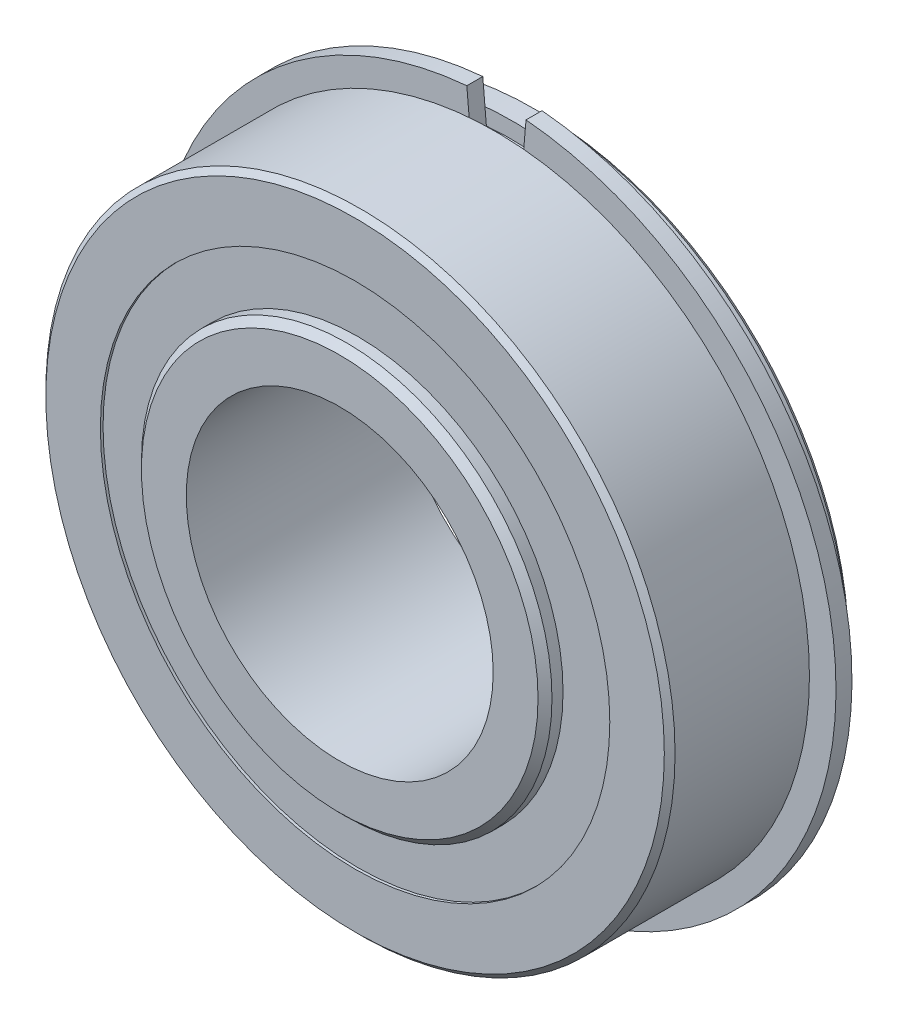
ISO-10303-21;
HEADER;
FILE_DESCRIPTION(('STEP AP214'),'2;1');
FILE_NAME('part.step','',(''),(''),'','','');
FILE_SCHEMA(('AUTOMOTIVE_DESIGN { 1 0 10303 214 1 1 1 1 }'));
ENDSEC;
DATA;
#1=APPLICATION_CONTEXT('core data for automotive mechanical design processes');
#2=APPLICATION_PROTOCOL_DEFINITION('international standard','automotive_design',2000,#1);
#3=PRODUCT_CONTEXT('',#1,'mechanical');
#4=PRODUCT('Part','Part','',(#3));
#5=PRODUCT_RELATED_PRODUCT_CATEGORY('part','',(#4));
#6=PRODUCT_DEFINITION_FORMATION('','',#4);
#7=PRODUCT_DEFINITION_CONTEXT('part definition',#1,'design');
#8=PRODUCT_DEFINITION('design','',#6,#7);
#9=PRODUCT_DEFINITION_SHAPE('','',#8);
#10=(LENGTH_UNIT() NAMED_UNIT(*) SI_UNIT(.MILLI.,.METRE.));
#11=(NAMED_UNIT(*) PLANE_ANGLE_UNIT() SI_UNIT($,.RADIAN.));
#12=(NAMED_UNIT(*) SI_UNIT($,.STERADIAN.) SOLID_ANGLE_UNIT());
#13=UNCERTAINTY_MEASURE_WITH_UNIT(LENGTH_MEASURE(1.E-05),#10,'distance_accuracy_value','');
#14=(GEOMETRIC_REPRESENTATION_CONTEXT(3) GLOBAL_UNCERTAINTY_ASSIGNED_CONTEXT((#13)) GLOBAL_UNIT_ASSIGNED_CONTEXT((#10,
#11,#12)) REPRESENTATION_CONTEXT('',''));
#15=CARTESIAN_POINT('',(0.,0.,0.));
#16=DIRECTION('',(0.,0.,1.));
#17=DIRECTION('',(1.,0.,0.));
#18=AXIS2_PLACEMENT_3D('',#15,#16,#17);
#19=CARTESIAN_POINT('',(0.,0.,-5.095875));
#20=DIRECTION('',(0.,0.,-1.));
#21=DIRECTION('',(-1.,0.,0.));
#22=AXIS2_PLACEMENT_3D('',#19,#20,#21);
#23=CYLINDRICAL_SURFACE('',#22,35.1282);
#24=CARTESIAN_POINT('',(0.,0.,-6.746875));
#25=DIRECTION('',(0.,0.,1.));
#26=DIRECTION('',(1.,0.,0.));
#27=AXIS2_PLACEMENT_3D('',#24,#25,#26);
#28=CIRCLE('',#27,35.1282);
#29=CARTESIAN_POINT('',(-3.0616243623883,34.9945265935065,-6.746875));
#30=VERTEX_POINT('',#29);
#31=CARTESIAN_POINT('',(3.06162436238829,34.9945265935065,-6.746875));
#32=VERTEX_POINT('',#31);
#33=EDGE_CURVE('E106',#30,#32,#28,.T.);
#34=ORIENTED_EDGE('',*,*,#33,.T.);
#35=DIRECTION('',(0.,0.,-1.));
#36=VECTOR('',#35,1.);
#37=CARTESIAN_POINT('',(3.06162436238829,34.9945265935065,-5.095875));
#38=LINE('',#37,#36);
#39=CARTESIAN_POINT('',(3.06162436238829,34.9945265935065,-5.095875));
#40=VERTEX_POINT('',#39);
#41=EDGE_CURVE('E12',#40,#32,#38,.T.);
#42=ORIENTED_EDGE('',*,*,#41,.F.);
#43=CARTESIAN_POINT('',(0.,0.,-5.095875));
#44=DIRECTION('',(0.,0.,1.));
#45=DIRECTION('',(1.,0.,0.));
#46=AXIS2_PLACEMENT_3D('',#43,#44,#45);
#47=CIRCLE('',#46,35.1282);
#48=CARTESIAN_POINT('',(-3.0616243623883,34.9945265935065,-5.095875));
#49=VERTEX_POINT('',#48);
#50=EDGE_CURVE('E94',#49,#40,#47,.T.);
#51=ORIENTED_EDGE('',*,*,#50,.F.);
#52=DIRECTION('',(0.,0.,-1.));
#53=VECTOR('',#52,1.);
#54=CARTESIAN_POINT('',(-3.0616243623883,34.9945265935065,-5.095875));
#55=LINE('',#54,#53);
#56=EDGE_CURVE('E102',#49,#30,#55,.T.);
#57=ORIENTED_EDGE('',*,*,#56,.T.);
#58=EDGE_LOOP('',(#34,#42,#51,#57));
#59=FACE_BOUND('',#58,.T.);
#60=ADVANCED_FACE('F43',(#59),#23,.T.);
#61=CARTESIAN_POINT('',(2.68983798760795,30.7449888843131,-5.095875));
#62=DIRECTION('',(0.996194698091745,-0.0871557427476582,0.));
#63=DIRECTION('',(0.0871557427476582,0.996194698091746,0.));
#64=AXIS2_PLACEMENT_3D('',#61,#62,#63);
#65=PLANE('',#64);
#66=DIRECTION('',(-0.0871557427476582,-0.996194698091746,0.));
#67=VECTOR('',#66,1.);
#68=CARTESIAN_POINT('',(2.68983798760795,30.7449888843131,-6.746875));
#69=LINE('',#68,#67);
#70=CARTESIAN_POINT('',(2.68983798760796,30.7449888843131,-6.746875));
#71=VERTEX_POINT('',#70);
#72=EDGE_CURVE('E98',#32,#71,#69,.T.);
#73=ORIENTED_EDGE('',*,*,#72,.T.);
#74=DIRECTION('',(0.,0.,-1.));
#75=VECTOR('',#74,1.);
#76=CARTESIAN_POINT('',(2.68983798760796,30.7449888843131,-5.095875));
#77=LINE('',#76,#75);
#78=CARTESIAN_POINT('',(2.68983798760796,30.7449888843131,-5.095875));
#79=VERTEX_POINT('',#78);
#80=EDGE_CURVE('E51',#79,#71,#77,.T.);
#81=ORIENTED_EDGE('',*,*,#80,.F.);
#82=DIRECTION('',(-0.0871557427476582,-0.996194698091746,0.));
#83=VECTOR('',#82,1.);
#84=CARTESIAN_POINT('',(2.68983798760795,30.7449888843131,-5.095875));
#85=LINE('',#84,#83);
#86=EDGE_CURVE('E89',#40,#79,#85,.T.);
#87=ORIENTED_EDGE('',*,*,#86,.F.);
#88=ORIENTED_EDGE('',*,*,#41,.T.);
#89=EDGE_LOOP('',(#73,#81,#87,#88));
#90=FACE_BOUND('',#89,.T.);
#91=ADVANCED_FACE('F97',(#90),#65,.F.);
#92=CARTESIAN_POINT('',(0.,0.,-5.095875));
#93=DIRECTION('',(0.,0.,-1.));
#94=DIRECTION('',(-1.,0.,0.));
#95=AXIS2_PLACEMENT_3D('',#92,#93,#94);
#96=CYLINDRICAL_SURFACE('',#95,30.8624297471232);
#97=CARTESIAN_POINT('',(0.,0.,-6.746875));
#98=DIRECTION('',(0.,0.,-1.));
#99=DIRECTION('',(-1.,0.,0.));
#100=AXIS2_PLACEMENT_3D('',#97,#98,#99);
#101=CIRCLE('',#100,30.8624297471232);
#102=CARTESIAN_POINT('',(-2.68983798760796,30.7449888843131,-6.746875));
#103=VERTEX_POINT('',#102);
#104=EDGE_CURVE('E76',#71,#103,#101,.T.);
#105=ORIENTED_EDGE('',*,*,#104,.T.);
#106=DIRECTION('',(0.,0.,-1.));
#107=VECTOR('',#106,1.);
#108=CARTESIAN_POINT('',(-2.68983798760796,30.7449888843131,-5.095875));
#109=LINE('',#108,#107);
#110=CARTESIAN_POINT('',(-2.68983798760796,30.7449888843131,-5.095875));
#111=VERTEX_POINT('',#110);
#112=EDGE_CURVE('E99',#111,#103,#109,.T.);
#113=ORIENTED_EDGE('',*,*,#112,.F.);
#114=CARTESIAN_POINT('',(0.,0.,-5.095875));
#115=DIRECTION('',(0.,0.,-1.));
#116=DIRECTION('',(-1.,0.,0.));
#117=AXIS2_PLACEMENT_3D('',#114,#115,#116);
#118=CIRCLE('',#117,30.8624297471232);
#119=EDGE_CURVE('E92',#79,#111,#118,.T.);
#120=ORIENTED_EDGE('',*,*,#119,.F.);
#121=ORIENTED_EDGE('',*,*,#80,.T.);
#122=EDGE_LOOP('',(#105,#113,#120,#121));
#123=FACE_BOUND('',#122,.T.);
#124=ADVANCED_FACE('F100',(#123),#96,.F.);
#125=CARTESIAN_POINT('',(-2.68983798760796,30.7449888843131,-5.095875));
#126=DIRECTION('',(-0.996194698091745,-0.0871557427476584,0.));
#127=DIRECTION('',(0.0871557427476584,-0.996194698091746,0.));
#128=AXIS2_PLACEMENT_3D('',#125,#126,#127);
#129=PLANE('',#128);
#130=DIRECTION('',(-0.0871557427476584,0.996194698091746,0.));
#131=VECTOR('',#130,1.);
#132=CARTESIAN_POINT('',(-2.68983798760796,30.7449888843131,-6.746875));
#133=LINE('',#132,#131);
#134=EDGE_CURVE('E82',#103,#30,#133,.T.);
#135=ORIENTED_EDGE('',*,*,#134,.T.);
#136=ORIENTED_EDGE('',*,*,#56,.F.);
#137=DIRECTION('',(-0.0871557427476584,0.996194698091746,0.));
#138=VECTOR('',#137,1.);
#139=CARTESIAN_POINT('',(-2.68983798760796,30.7449888843131,-5.095875));
#140=LINE('',#139,#138);
#141=EDGE_CURVE('E59',#111,#49,#140,.T.);
#142=ORIENTED_EDGE('',*,*,#141,.F.);
#143=ORIENTED_EDGE('',*,*,#112,.T.);
#144=EDGE_LOOP('',(#135,#136,#142,#143));
#145=FACE_BOUND('',#144,.T.);
#146=ADVANCED_FACE('F113',(#145),#129,.F.);
#147=CARTESIAN_POINT('',(0.,0.,-5.095875));
#148=DIRECTION('',(0.,0.,1.));
#149=DIRECTION('',(1.,0.,0.));
#150=AXIS2_PLACEMENT_3D('',#147,#148,#149);
#151=PLANE('',#150);
#152=ORIENTED_EDGE('',*,*,#50,.T.);
#153=ORIENTED_EDGE('',*,*,#86,.T.);
#154=ORIENTED_EDGE('',*,*,#119,.T.);
#155=ORIENTED_EDGE('',*,*,#141,.T.);
#156=EDGE_LOOP('',(#152,#153,#154,#155));
#157=FACE_BOUND('',#156,.T.);
#158=ADVANCED_FACE('F90',(#157),#151,.T.);
#159=CARTESIAN_POINT('',(0.,0.,-6.746875));
#160=DIRECTION('',(0.,0.,1.));
#161=DIRECTION('',(1.,0.,0.));
#162=AXIS2_PLACEMENT_3D('',#159,#160,#161);
#163=PLANE('',#162);
#164=ORIENTED_EDGE('',*,*,#33,.F.);
#165=ORIENTED_EDGE('',*,*,#134,.F.);
#166=ORIENTED_EDGE('',*,*,#104,.F.);
#167=ORIENTED_EDGE('',*,*,#72,.F.);
#168=EDGE_LOOP('',(#164,#165,#166,#167));
#169=FACE_BOUND('',#168,.T.);
#170=ADVANCED_FACE('F116',(#169),#163,.F.);
#171=CLOSED_SHELL('',(#60,#91,#124,#146,#158,#170));
#172=MANIFOLD_SOLID_BREP('B2',#171);
#173=CARTESIAN_POINT('',(0.,26.3479766221232,-9.24718750000001));
#174=DIRECTION('',(0.,0.,1.));
#175=DIRECTION('',(1.,0.,0.));
#176=AXIS2_PLACEMENT_3D('',#173,#174,#175);
#177=PLANE('',#176);
#178=CARTESIAN_POINT('',(0.,0.,-9.24718750000001));
#179=DIRECTION('',(0.,0.,1.));
#180=DIRECTION('',(1.,0.,0.));
#181=AXIS2_PLACEMENT_3D('',#178,#179,#180);
#182=CIRCLE('',#181,26.3479766221232);
#183=CARTESIAN_POINT('',(26.3479766221232,0.,-9.24718750000001));
#184=VERTEX_POINT('',#183);
#185=EDGE_CURVE('E188',#184,#184,#182,.T.);
#186=ORIENTED_EDGE('',*,*,#185,.F.);
#187=EDGE_LOOP('',(#186));
#188=FACE_BOUND('',#187,.T.);
#189=CARTESIAN_POINT('',(0.,0.,-9.24718750000001));
#190=DIRECTION('',(0.,0.,1.));
#191=DIRECTION('',(1.,0.,0.));
#192=AXIS2_PLACEMENT_3D('',#189,#190,#191);
#193=CIRCLE('',#192,21.2344);
#194=CARTESIAN_POINT('',(21.2344,0.,-9.24718750000001));
#195=VERTEX_POINT('',#194);
#196=EDGE_CURVE('E42',#195,#195,#193,.T.);
#197=ORIENTED_EDGE('',*,*,#196,.T.);
#198=EDGE_LOOP('',(#197));
#199=FACE_BOUND('',#198,.T.);
#200=ADVANCED_FACE('F174',(#188,#199),#177,.F.);
#201=CARTESIAN_POINT('',(0.,0.,11.1125));
#202=DIRECTION('',(0.,0.,1.));
#203=DIRECTION('',(1.,0.,0.));
#204=AXIS2_PLACEMENT_3D('',#201,#202,#203);
#205=CYLINDRICAL_SURFACE('',#204,21.2344);
#206=ORIENTED_EDGE('',*,*,#196,.F.);
#207=EDGE_LOOP('',(#206));
#208=FACE_BOUND('',#207,.T.);
#209=CARTESIAN_POINT('',(0.,0.,-4.27720324424649));
#210=DIRECTION('',(0.,0.,1.));
#211=DIRECTION('',(1.,0.,0.));
#212=AXIS2_PLACEMENT_3D('',#209,#210,#211);
#213=CIRCLE('',#212,21.2344);
#214=CARTESIAN_POINT('',(21.2344,0.,-4.27720324424649));
#215=VERTEX_POINT('',#214);
#216=EDGE_CURVE('E180',#215,#215,#213,.T.);
#217=ORIENTED_EDGE('',*,*,#216,.T.);
#218=EDGE_LOOP('',(#217));
#219=FACE_BOUND('',#218,.T.);
#220=ADVANCED_FACE('F197',(#208,#219),#205,.F.);
#221=CARTESIAN_POINT('',(0.,26.3479766221232,-4.27720324424649));
#222=DIRECTION('',(0.,0.,-1.));
#223=DIRECTION('',(-1.,0.,0.));
#224=AXIS2_PLACEMENT_3D('',#221,#222,#223);
#225=PLANE('',#224);
#226=ORIENTED_EDGE('',*,*,#216,.F.);
#227=EDGE_LOOP('',(#226));
#228=FACE_BOUND('',#227,.T.);
#229=CARTESIAN_POINT('',(0.,0.,-4.27720324424649));
#230=DIRECTION('',(0.,0.,1.));
#231=DIRECTION('',(1.,0.,0.));
#232=AXIS2_PLACEMENT_3D('',#229,#230,#231);
#233=CIRCLE('',#232,26.3479766221232);
#234=CARTESIAN_POINT('',(26.3479766221232,0.,-4.27720324424649));
#235=VERTEX_POINT('',#234);
#236=EDGE_CURVE('E184',#235,#235,#233,.T.);
#237=ORIENTED_EDGE('',*,*,#236,.T.);
#238=EDGE_LOOP('',(#237));
#239=FACE_BOUND('',#238,.T.);
#240=ADVANCED_FACE('F201',(#228,#239),#225,.F.);
#241=CARTESIAN_POINT('',(0.,0.,11.1125));
#242=DIRECTION('',(0.,0.,1.));
#243=DIRECTION('',(1.,0.,0.));
#244=AXIS2_PLACEMENT_3D('',#241,#242,#243);
#245=CYLINDRICAL_SURFACE('',#244,26.3479766221232);
#246=ORIENTED_EDGE('',*,*,#236,.F.);
#247=EDGE_LOOP('',(#246));
#248=FACE_BOUND('',#247,.T.);
#249=ORIENTED_EDGE('',*,*,#185,.T.);
#250=EDGE_LOOP('',(#249));
#251=FACE_BOUND('',#250,.T.);
#252=ADVANCED_FACE('F194',(#248,#251),#245,.T.);
#253=CLOSED_SHELL('',(#200,#220,#240,#252));
#254=MANIFOLD_SOLID_BREP('B6',#253);
#255=CARTESIAN_POINT('',(0.,26.3479766221232,9.2471875));
#256=DIRECTION('',(0.,0.,-1.));
#257=DIRECTION('',(-1.,0.,0.));
#258=AXIS2_PLACEMENT_3D('',#255,#256,#257);
#259=PLANE('',#258);
#260=CARTESIAN_POINT('',(0.,0.,9.2471875));
#261=DIRECTION('',(0.,0.,1.));
#262=DIRECTION('',(1.,0.,0.));
#263=AXIS2_PLACEMENT_3D('',#260,#261,#262);
#264=CIRCLE('',#263,21.2344);
#265=CARTESIAN_POINT('',(21.2344,0.,9.2471875));
#266=VERTEX_POINT('',#265);
#267=EDGE_CURVE('E173',#266,#266,#264,.T.);
#268=ORIENTED_EDGE('',*,*,#267,.F.);
#269=EDGE_LOOP('',(#268));
#270=FACE_BOUND('',#269,.T.);
#271=CARTESIAN_POINT('',(0.,0.,9.2471875));
#272=DIRECTION('',(0.,0.,1.));
#273=DIRECTION('',(1.,0.,0.));
#274=AXIS2_PLACEMENT_3D('',#271,#272,#273);
#275=CIRCLE('',#274,26.3479766221232);
#276=CARTESIAN_POINT('',(26.3479766221232,0.,9.2471875));
#277=VERTEX_POINT('',#276);
#278=EDGE_CURVE('E255',#277,#277,#275,.T.);
#279=ORIENTED_EDGE('',*,*,#278,.T.);
#280=EDGE_LOOP('',(#279));
#281=FACE_BOUND('',#280,.T.);
#282=ADVANCED_FACE('F241',(#270,#281),#259,.F.);
#283=CARTESIAN_POINT('',(0.,0.,11.1125));
#284=DIRECTION('',(0.,0.,1.));
#285=DIRECTION('',(1.,0.,0.));
#286=AXIS2_PLACEMENT_3D('',#283,#284,#285);
#287=CYLINDRICAL_SURFACE('',#286,21.2344);
#288=CARTESIAN_POINT('',(0.,0.,4.27720324424647));
#289=DIRECTION('',(0.,0.,1.));
#290=DIRECTION('',(1.,0.,0.));
#291=AXIS2_PLACEMENT_3D('',#288,#289,#290);
#292=CIRCLE('',#291,21.2344);
#293=CARTESIAN_POINT('',(21.2344,0.,4.27720324424647));
#294=VERTEX_POINT('',#293);
#295=EDGE_CURVE('E247',#294,#294,#292,.T.);
#296=ORIENTED_EDGE('',*,*,#295,.F.);
#297=EDGE_LOOP('',(#296));
#298=FACE_BOUND('',#297,.T.);
#299=ORIENTED_EDGE('',*,*,#267,.T.);
#300=EDGE_LOOP('',(#299));
#301=FACE_BOUND('',#300,.T.);
#302=ADVANCED_FACE('F270',(#298,#301),#287,.F.);
#303=CARTESIAN_POINT('',(0.,26.3479766221232,4.27720324424647));
#304=DIRECTION('',(0.,0.,1.));
#305=DIRECTION('',(1.,0.,0.));
#306=AXIS2_PLACEMENT_3D('',#303,#304,#305);
#307=PLANE('',#306);
#308=CARTESIAN_POINT('',(0.,0.,4.27720324424647));
#309=DIRECTION('',(0.,0.,1.));
#310=DIRECTION('',(1.,0.,0.));
#311=AXIS2_PLACEMENT_3D('',#308,#309,#310);
#312=CIRCLE('',#311,26.3479766221232);
#313=CARTESIAN_POINT('',(26.3479766221232,0.,4.27720324424647));
#314=VERTEX_POINT('',#313);
#315=EDGE_CURVE('E251',#314,#314,#312,.T.);
#316=ORIENTED_EDGE('',*,*,#315,.F.);
#317=EDGE_LOOP('',(#316));
#318=FACE_BOUND('',#317,.T.);
#319=ORIENTED_EDGE('',*,*,#295,.T.);
#320=EDGE_LOOP('',(#319));
#321=FACE_BOUND('',#320,.T.);
#322=ADVANCED_FACE('F265',(#318,#321),#307,.F.);
#323=CARTESIAN_POINT('',(0.,0.,11.1125));
#324=DIRECTION('',(0.,0.,1.));
#325=DIRECTION('',(1.,0.,0.));
#326=AXIS2_PLACEMENT_3D('',#323,#324,#325);
#327=CYLINDRICAL_SURFACE('',#326,26.3479766221232);
#328=ORIENTED_EDGE('',*,*,#278,.F.);
#329=EDGE_LOOP('',(#328));
#330=FACE_BOUND('',#329,.T.);
#331=ORIENTED_EDGE('',*,*,#315,.T.);
#332=EDGE_LOOP('',(#331));
#333=FACE_BOUND('',#332,.T.);
#334=ADVANCED_FACE('F262',(#330,#333),#327,.T.);
#335=CLOSED_SHELL('',(#282,#302,#322,#334));
#336=MANIFOLD_SOLID_BREP('B37',#335);
#337=CARTESIAN_POINT('',(-17.1186132307879,17.1186132307883,0.));
#338=DIRECTION('',(0.,0.,1.));
#339=DIRECTION('',(-0.707106781186539,0.707106781186556,0.));
#340=AXIS2_PLACEMENT_3D('',#337,#338,#339);
#341=SPHERICAL_SURFACE('',#340,4.27720324424648);
#342=CARTESIAN_POINT('',(-17.1186132307879,17.1186132307883,4.27720324424647));
#343=VERTEX_POINT('',#342);
#344=VERTEX_LOOP('',#343);
#345=FACE_BOUND('',#344,.T.);
#346=ADVANCED_FACE('F308',(#345),#341,.T.);
#347=CLOSED_SHELL('',(#346));
#348=MANIFOLD_SOLID_BREP('B168',#347);
#349=CARTESIAN_POINT('',(-24.209375,2.53579743112666E-13,0.));
#350=DIRECTION('',(0.,0.,1.));
#351=DIRECTION('',(-1.,0.,0.));
#352=AXIS2_PLACEMENT_3D('',#349,#350,#351);
#353=SPHERICAL_SURFACE('',#352,4.27720324424648);
#354=CARTESIAN_POINT('',(-24.209375,2.53579743112666E-13,4.27720324424647));
#355=VERTEX_POINT('',#354);
#356=VERTEX_LOOP('',#355);
#357=FACE_BOUND('',#356,.T.);
#358=ADVANCED_FACE('F328',(#357),#353,.T.);
#359=CLOSED_SHELL('',(#358));
#360=MANIFOLD_SOLID_BREP('B237',#359);
#361=CARTESIAN_POINT('',(-17.1186132307882,-17.1186132307879,0.));
#362=DIRECTION('',(0.,0.,1.));
#363=DIRECTION('',(-0.707106781186554,-0.707106781186541,0.));
#364=AXIS2_PLACEMENT_3D('',#361,#362,#363);
#365=SPHERICAL_SURFACE('',#364,4.27720324424648);
#366=CARTESIAN_POINT('',(-17.1186132307882,-17.1186132307879,4.27720324424647));
#367=VERTEX_POINT('',#366);
#368=VERTEX_LOOP('',#367);
#369=FACE_BOUND('',#368,.T.);
#370=ADVANCED_FACE('F348',(#369),#365,.T.);
#371=CLOSED_SHELL('',(#370));
#372=MANIFOLD_SOLID_BREP('B304',#371);
#373=CARTESIAN_POINT('',(-1.69053162075111E-13,-24.209375,0.));
#374=DIRECTION('',(0.,0.,1.));
#375=DIRECTION('',(0.,-1.,0.));
#376=AXIS2_PLACEMENT_3D('',#373,#374,#375);
#377=SPHERICAL_SURFACE('',#376,4.27720324424648);
#378=CARTESIAN_POINT('',(-1.69053162075111E-13,-24.209375,4.27720324424647));
#379=VERTEX_POINT('',#378);
#380=VERTEX_LOOP('',#379);
#381=FACE_BOUND('',#380,.T.);
#382=ADVANCED_FACE('F368',(#381),#377,.T.);
#383=CLOSED_SHELL('',(#382));
#384=MANIFOLD_SOLID_BREP('B324',#383);
#385=CARTESIAN_POINT('',(17.118613230788,-17.1186132307882,0.));
#386=DIRECTION('',(0.,0.,1.));
#387=DIRECTION('',(0.707106781186544,-0.707106781186551,0.));
#388=AXIS2_PLACEMENT_3D('',#385,#386,#387);
#389=SPHERICAL_SURFACE('',#388,4.27720324424648);
#390=CARTESIAN_POINT('',(17.118613230788,-17.1186132307882,4.27720324424647));
#391=VERTEX_POINT('',#390);
#392=VERTEX_LOOP('',#391);
#393=FACE_BOUND('',#392,.T.);
#394=ADVANCED_FACE('F388',(#393),#389,.T.);
#395=CLOSED_SHELL('',(#394));
#396=MANIFOLD_SOLID_BREP('B344',#395);
#397=CARTESIAN_POINT('',(24.209375,0.,0.));
#398=DIRECTION('',(0.,0.,1.));
#399=DIRECTION('',(1.,0.,0.));
#400=AXIS2_PLACEMENT_3D('',#397,#398,#399);
#401=SPHERICAL_SURFACE('',#400,4.27720324424648);
#402=CARTESIAN_POINT('',(24.209375,0.,4.27720324424647));
#403=VERTEX_POINT('',#402);
#404=VERTEX_LOOP('',#403);
#405=FACE_BOUND('',#404,.T.);
#406=ADVANCED_FACE('F408',(#405),#401,.T.);
#407=CLOSED_SHELL('',(#406));
#408=MANIFOLD_SOLID_BREP('B364',#407);
#409=CARTESIAN_POINT('',(17.1186132307881,17.118613230788,0.));
#410=DIRECTION('',(0.,0.,1.));
#411=DIRECTION('',(0.707106781186549,0.707106781186546,0.));
#412=AXIS2_PLACEMENT_3D('',#409,#410,#411);
#413=SPHERICAL_SURFACE('',#412,4.27720324424648);
#414=CARTESIAN_POINT('',(17.1186132307881,17.118613230788,4.27720324424647));
#415=VERTEX_POINT('',#414);
#416=VERTEX_LOOP('',#415);
#417=FACE_BOUND('',#416,.T.);
#418=ADVANCED_FACE('F428',(#417),#413,.T.);
#419=CLOSED_SHELL('',(#418));
#420=MANIFOLD_SOLID_BREP('B384',#419);
#421=CARTESIAN_POINT('',(0.,24.209375,0.));
#422=DIRECTION('',(0.,0.,1.));
#423=DIRECTION('',(0.,1.,0.));
#424=AXIS2_PLACEMENT_3D('',#421,#422,#423);
#425=SPHERICAL_SURFACE('',#424,4.27720324424648);
#426=CARTESIAN_POINT('',(0.,24.209375,4.27720324424647));
#427=VERTEX_POINT('',#426);
#428=VERTEX_LOOP('',#427);
#429=FACE_BOUND('',#428,.T.);
#430=ADVANCED_FACE('F450',(#429),#425,.T.);
#431=CLOSED_SHELL('',(#430));
#432=MANIFOLD_SOLID_BREP('B404',#431);
#433=CARTESIAN_POINT('',(0.,0.,-11.1125));
#434=DIRECTION('',(0.,0.,1.));
#435=DIRECTION('',(1.,0.,0.));
#436=AXIS2_PLACEMENT_3D('',#433,#434,#435);
#437=CONICAL_SURFACE('',#436,20.5125628953229,0.785398163397448);
#438=CARTESIAN_POINT('',(0.,0.,-10.3906628953229));
#439=DIRECTION('',(0.,0.,1.));
#440=DIRECTION('',(1.,0.,0.));
#441=AXIS2_PLACEMENT_3D('',#438,#439,#440);
#442=CIRCLE('',#441,21.2344);
#443=CARTESIAN_POINT('',(21.2344,0.,-10.3906628953229));
#444=VERTEX_POINT('',#443);
#445=EDGE_CURVE('E497',#444,#444,#442,.T.);
#446=ORIENTED_EDGE('',*,*,#445,.F.);
#447=EDGE_LOOP('',(#446));
#448=FACE_BOUND('',#447,.T.);
#449=CARTESIAN_POINT('',(0.,0.,-11.1125));
#450=DIRECTION('',(0.,0.,1.));
#451=DIRECTION('',(1.,0.,0.));
#452=AXIS2_PLACEMENT_3D('',#449,#450,#451);
#453=CIRCLE('',#452,20.5125628953229);
#454=CARTESIAN_POINT('',(20.5125628953229,0.,-11.1125));
#455=VERTEX_POINT('',#454);
#456=EDGE_CURVE('E449',#455,#455,#453,.T.);
#457=ORIENTED_EDGE('',*,*,#456,.T.);
#458=EDGE_LOOP('',(#457));
#459=FACE_BOUND('',#458,.T.);
#460=ADVANCED_FACE('F469',(#448,#459),#437,.T.);
#461=CARTESIAN_POINT('',(0.,20.5125628953229,-11.1125));
#462=DIRECTION('',(0.,0.,1.));
#463=DIRECTION('',(1.,0.,0.));
#464=AXIS2_PLACEMENT_3D('',#461,#462,#463);
#465=PLANE('',#464);
#466=ORIENTED_EDGE('',*,*,#456,.F.);
#467=EDGE_LOOP('',(#466));
#468=FACE_BOUND('',#467,.T.);
#469=CARTESIAN_POINT('',(0.,0.,-11.1125));
#470=DIRECTION('',(0.,0.,1.));
#471=DIRECTION('',(1.,0.,0.));
#472=AXIS2_PLACEMENT_3D('',#469,#470,#471);
#473=CIRCLE('',#472,15.875);
#474=CARTESIAN_POINT('',(15.875,0.,-11.1125));
#475=VERTEX_POINT('',#474);
#476=EDGE_CURVE('E475',#475,#475,#473,.T.);
#477=ORIENTED_EDGE('',*,*,#476,.T.);
#478=EDGE_LOOP('',(#477));
#479=FACE_BOUND('',#478,.T.);
#480=ADVANCED_FACE('F504',(#468,#479),#465,.F.);
#481=CARTESIAN_POINT('',(0.,0.,11.1125));
#482=DIRECTION('',(0.,0.,1.));
#483=DIRECTION('',(1.,0.,0.));
#484=AXIS2_PLACEMENT_3D('',#481,#482,#483);
#485=CYLINDRICAL_SURFACE('',#484,15.875);
#486=ORIENTED_EDGE('',*,*,#476,.F.);
#487=EDGE_LOOP('',(#486));
#488=FACE_BOUND('',#487,.T.);
#489=CARTESIAN_POINT('',(0.,0.,11.1125));
#490=DIRECTION('',(0.,0.,1.));
#491=DIRECTION('',(1.,0.,0.));
#492=AXIS2_PLACEMENT_3D('',#489,#490,#491);
#493=CIRCLE('',#492,15.875);
#494=CARTESIAN_POINT('',(15.875,0.,11.1125));
#495=VERTEX_POINT('',#494);
#496=EDGE_CURVE('E479',#495,#495,#493,.T.);
#497=ORIENTED_EDGE('',*,*,#496,.T.);
#498=EDGE_LOOP('',(#497));
#499=FACE_BOUND('',#498,.T.);
#500=ADVANCED_FACE('F508',(#488,#499),#485,.F.);
#501=CARTESIAN_POINT('',(0.,20.5125628953229,11.1125));
#502=DIRECTION('',(0.,0.,-1.));
#503=DIRECTION('',(-1.,0.,0.));
#504=AXIS2_PLACEMENT_3D('',#501,#502,#503);
#505=PLANE('',#504);
#506=ORIENTED_EDGE('',*,*,#496,.F.);
#507=EDGE_LOOP('',(#506));
#508=FACE_BOUND('',#507,.T.);
#509=CARTESIAN_POINT('',(0.,0.,11.1125));
#510=DIRECTION('',(0.,0.,1.));
#511=DIRECTION('',(1.,0.,0.));
#512=AXIS2_PLACEMENT_3D('',#509,#510,#511);
#513=CIRCLE('',#512,20.5125628953229);
#514=CARTESIAN_POINT('',(20.5125628953229,0.,11.1125));
#515=VERTEX_POINT('',#514);
#516=EDGE_CURVE('E483',#515,#515,#513,.T.);
#517=ORIENTED_EDGE('',*,*,#516,.T.);
#518=EDGE_LOOP('',(#517));
#519=FACE_BOUND('',#518,.T.);
#520=ADVANCED_FACE('F513',(#508,#519),#505,.F.);
#521=CARTESIAN_POINT('',(0.,0.,10.3906628953229));
#522=DIRECTION('',(0.,0.,-1.));
#523=DIRECTION('',(-1.,0.,0.));
#524=AXIS2_PLACEMENT_3D('',#521,#522,#523);
#525=CONICAL_SURFACE('',#524,21.2344,0.785398163397446);
#526=ORIENTED_EDGE('',*,*,#516,.F.);
#527=EDGE_LOOP('',(#526));
#528=FACE_BOUND('',#527,.T.);
#529=CARTESIAN_POINT('',(0.,0.,10.3906628953229));
#530=DIRECTION('',(0.,0.,1.));
#531=DIRECTION('',(1.,0.,0.));
#532=AXIS2_PLACEMENT_3D('',#529,#530,#531);
#533=CIRCLE('',#532,21.2344);
#534=CARTESIAN_POINT('',(21.2344,0.,10.3906628953229));
#535=VERTEX_POINT('',#534);
#536=EDGE_CURVE('E488',#535,#535,#533,.T.);
#537=ORIENTED_EDGE('',*,*,#536,.T.);
#538=EDGE_LOOP('',(#537));
#539=FACE_BOUND('',#538,.T.);
#540=ADVANCED_FACE('F519',(#528,#539),#525,.T.);
#541=CARTESIAN_POINT('',(0.,0.,11.1125));
#542=DIRECTION('',(0.,0.,1.));
#543=DIRECTION('',(1.,0.,0.));
#544=AXIS2_PLACEMENT_3D('',#541,#542,#543);
#545=CYLINDRICAL_SURFACE('',#544,21.2344);
#546=ORIENTED_EDGE('',*,*,#536,.F.);
#547=EDGE_LOOP('',(#546));
#548=FACE_BOUND('',#547,.T.);
#549=CARTESIAN_POINT('',(0.,0.,3.07310776608428));
#550=DIRECTION('',(0.,0.,1.));
#551=DIRECTION('',(1.,0.,0.));
#552=AXIS2_PLACEMENT_3D('',#549,#550,#551);
#553=CIRCLE('',#552,21.2344);
#554=CARTESIAN_POINT('',(21.2344,0.,3.07310776608428));
#555=VERTEX_POINT('',#554);
#556=EDGE_CURVE('E491',#555,#555,#553,.T.);
#557=ORIENTED_EDGE('',*,*,#556,.T.);
#558=EDGE_LOOP('',(#557));
#559=FACE_BOUND('',#558,.T.);
#560=ADVANCED_FACE('F523',(#548,#559),#545,.T.);
#561=CARTESIAN_POINT('',(0.,0.,0.));
#562=DIRECTION('',(0.,0.,1.));
#563=DIRECTION('',(1.,0.,0.));
#564=AXIS2_PLACEMENT_3D('',#561,#562,#563);
#565=TOROIDAL_SURFACE('',#564,24.209375,4.27720324424647);
#566=ORIENTED_EDGE('',*,*,#556,.F.);
#567=EDGE_LOOP('',(#566));
#568=FACE_BOUND('',#567,.T.);
#569=CARTESIAN_POINT('',(0.,0.,-3.07310776608429));
#570=DIRECTION('',(0.,0.,1.));
#571=DIRECTION('',(1.,0.,0.));
#572=AXIS2_PLACEMENT_3D('',#569,#570,#571);
#573=CIRCLE('',#572,21.2344);
#574=CARTESIAN_POINT('',(21.2344,0.,-3.07310776608429));
#575=VERTEX_POINT('',#574);
#576=EDGE_CURVE('E494',#575,#575,#573,.T.);
#577=ORIENTED_EDGE('',*,*,#576,.T.);
#578=EDGE_LOOP('',(#577));
#579=FACE_BOUND('',#578,.T.);
#580=ADVANCED_FACE('F527',(#568,#579),#565,.F.);
#581=CARTESIAN_POINT('',(0.,0.,11.1125));
#582=DIRECTION('',(0.,0.,1.));
#583=DIRECTION('',(1.,0.,0.));
#584=AXIS2_PLACEMENT_3D('',#581,#582,#583);
#585=CYLINDRICAL_SURFACE('',#584,21.2344);
#586=ORIENTED_EDGE('',*,*,#576,.F.);
#587=EDGE_LOOP('',(#586));
#588=FACE_BOUND('',#587,.T.);
#589=ORIENTED_EDGE('',*,*,#445,.T.);
#590=EDGE_LOOP('',(#589));
#591=FACE_BOUND('',#590,.T.);
#592=ADVANCED_FACE('F501',(#588,#591),#585,.T.);
#593=CLOSED_SHELL('',(#460,#480,#500,#520,#540,#560,#580,#592));
#594=MANIFOLD_SOLID_BREP('B424',#593);
#595=CARTESIAN_POINT('',(0.,0.,11.1125));
#596=DIRECTION('',(0.,0.,1.));
#597=DIRECTION('',(1.,0.,0.));
#598=AXIS2_PLACEMENT_3D('',#595,#596,#597);
#599=CYLINDRICAL_SURFACE('',#598,32.54375);
#600=CARTESIAN_POINT('',(0.,0.,-8.96937499999999));
#601=DIRECTION('',(0.,0.,1.));
#602=DIRECTION('',(1.,0.,0.));
#603=AXIS2_PLACEMENT_3D('',#600,#601,#602);
#604=CIRCLE('',#603,32.54375);
#605=CARTESIAN_POINT('',(32.54375,0.,-8.96937499999999));
#606=VERTEX_POINT('',#605);
#607=EDGE_CURVE('E597',#606,#606,#604,.T.);
#608=ORIENTED_EDGE('',*,*,#607,.T.);
#609=EDGE_LOOP('',(#608));
#610=FACE_BOUND('',#609,.T.);
#611=CARTESIAN_POINT('',(0.,0.,-6.746875));
#612=DIRECTION('',(0.,0.,1.));
#613=DIRECTION('',(1.,0.,0.));
#614=AXIS2_PLACEMENT_3D('',#611,#612,#613);
#615=CIRCLE('',#614,32.54375);
#616=CARTESIAN_POINT('',(32.54375,0.,-6.746875));
#617=VERTEX_POINT('',#616);
#618=EDGE_CURVE('E631',#617,#617,#615,.T.);
#619=ORIENTED_EDGE('',*,*,#618,.F.);
#620=EDGE_LOOP('',(#619));
#621=FACE_BOUND('',#620,.T.);
#622=ADVANCED_FACE('F590',(#610,#621),#599,.T.);
#623=CARTESIAN_POINT('',(0.,0.,8.969375));
#624=DIRECTION('',(0.,0.,1.));
#625=DIRECTION('',(1.,0.,0.));
#626=AXIS2_PLACEMENT_3D('',#623,#624,#625);
#627=CIRCLE('',#626,32.54375);
#628=CARTESIAN_POINT('',(32.54375,0.,8.969375));
#629=VERTEX_POINT('',#628);
#630=EDGE_CURVE('E468',#629,#629,#627,.T.);
#631=ORIENTED_EDGE('',*,*,#630,.F.);
#632=EDGE_LOOP('',(#631));
#633=FACE_BOUND('',#632,.T.);
#634=CARTESIAN_POINT('',(0.,0.,-4.930775));
#635=DIRECTION('',(0.,0.,1.));
#636=DIRECTION('',(1.,0.,0.));
#637=AXIS2_PLACEMENT_3D('',#634,#635,#636);
#638=CIRCLE('',#637,32.54375);
#639=CARTESIAN_POINT('',(32.54375,0.,-4.930775));
#640=VERTEX_POINT('',#639);
#641=EDGE_CURVE('E628',#640,#640,#638,.T.);
#642=ORIENTED_EDGE('',*,*,#641,.T.);
#643=EDGE_LOOP('',(#642));
#644=FACE_BOUND('',#643,.T.);
#645=ADVANCED_FACE('F639',(#633,#644),#599,.T.);
#646=CARTESIAN_POINT('',(0.,0.,8.969375));
#647=DIRECTION('',(0.,0.,-1.));
#648=DIRECTION('',(-1.,0.,0.));
#649=AXIS2_PLACEMENT_3D('',#646,#647,#648);
#650=CONICAL_SURFACE('',#649,32.54375,0.785398163397453);
#651=CARTESIAN_POINT('',(0.,0.,9.525));
#652=DIRECTION('',(0.,0.,1.));
#653=DIRECTION('',(1.,0.,0.));
#654=AXIS2_PLACEMENT_3D('',#651,#652,#653);
#655=CIRCLE('',#654,31.988125);
#656=CARTESIAN_POINT('',(31.988125,0.,9.525));
#657=VERTEX_POINT('',#656);
#658=EDGE_CURVE('E619',#657,#657,#655,.T.);
#659=ORIENTED_EDGE('',*,*,#658,.F.);
#660=EDGE_LOOP('',(#659));
#661=FACE_BOUND('',#660,.T.);
#662=ORIENTED_EDGE('',*,*,#630,.T.);
#663=EDGE_LOOP('',(#662));
#664=FACE_BOUND('',#663,.T.);
#665=ADVANCED_FACE('F592',(#661,#664),#650,.T.);
#666=CARTESIAN_POINT('',(0.,0.,-9.525));
#667=DIRECTION('',(0.,0.,1.));
#668=DIRECTION('',(1.,0.,0.));
#669=AXIS2_PLACEMENT_3D('',#666,#667,#668);
#670=CONICAL_SURFACE('',#669,31.988125,0.785398163397442);
#671=ORIENTED_EDGE('',*,*,#607,.F.);
#672=EDGE_LOOP('',(#671));
#673=FACE_BOUND('',#672,.T.);
#674=CARTESIAN_POINT('',(0.,0.,-9.525));
#675=DIRECTION('',(0.,0.,1.));
#676=DIRECTION('',(1.,0.,0.));
#677=AXIS2_PLACEMENT_3D('',#674,#675,#676);
#678=CIRCLE('',#677,31.988125);
#679=CARTESIAN_POINT('',(31.988125,0.,-9.525));
#680=VERTEX_POINT('',#679);
#681=EDGE_CURVE('E601',#680,#680,#678,.T.);
#682=ORIENTED_EDGE('',*,*,#681,.T.);
#683=EDGE_LOOP('',(#682));
#684=FACE_BOUND('',#683,.T.);
#685=ADVANCED_FACE('F645',(#673,#684),#670,.T.);
#686=CARTESIAN_POINT('',(0.,31.988125,-9.525));
#687=DIRECTION('',(0.,0.,1.));
#688=DIRECTION('',(1.,0.,0.));
#689=AXIS2_PLACEMENT_3D('',#686,#687,#688);
#690=PLANE('',#689);
#691=ORIENTED_EDGE('',*,*,#681,.F.);
#692=EDGE_LOOP('',(#691));
#693=FACE_BOUND('',#692,.T.);
#694=CARTESIAN_POINT('',(0.,0.,-9.525));
#695=DIRECTION('',(0.,0.,1.));
#696=DIRECTION('',(1.,0.,0.));
#697=AXIS2_PLACEMENT_3D('',#694,#695,#696);
#698=CIRCLE('',#697,26.3479766221232);
#699=CARTESIAN_POINT('',(26.3479766221232,0.,-9.525));
#700=VERTEX_POINT('',#699);
#701=EDGE_CURVE('E605',#700,#700,#698,.T.);
#702=ORIENTED_EDGE('',*,*,#701,.T.);
#703=EDGE_LOOP('',(#702));
#704=FACE_BOUND('',#703,.T.);
#705=ADVANCED_FACE('F648',(#693,#704),#690,.F.);
#706=CARTESIAN_POINT('',(0.,0.,11.1125));
#707=DIRECTION('',(0.,0.,1.));
#708=DIRECTION('',(1.,0.,0.));
#709=AXIS2_PLACEMENT_3D('',#706,#707,#708);
#710=CYLINDRICAL_SURFACE('',#709,26.3479766221232);
#711=ORIENTED_EDGE('',*,*,#701,.F.);
#712=EDGE_LOOP('',(#711));
#713=FACE_BOUND('',#712,.T.);
#714=CARTESIAN_POINT('',(0.,0.,-3.70416666666667));
#715=DIRECTION('',(0.,0.,1.));
#716=DIRECTION('',(1.,0.,0.));
#717=AXIS2_PLACEMENT_3D('',#714,#715,#716);
#718=CIRCLE('',#717,26.3479766221232);
#719=CARTESIAN_POINT('',(26.3479766221232,0.,-3.70416666666667));
#720=VERTEX_POINT('',#719);
#721=EDGE_CURVE('E610',#720,#720,#718,.T.);
#722=ORIENTED_EDGE('',*,*,#721,.T.);
#723=EDGE_LOOP('',(#722));
#724=FACE_BOUND('',#723,.T.);
#725=ADVANCED_FACE('F652',(#713,#724),#710,.F.);
#726=CARTESIAN_POINT('',(0.,0.,0.));
#727=DIRECTION('',(0.,0.,1.));
#728=DIRECTION('',(1.,0.,0.));
#729=AXIS2_PLACEMENT_3D('',#726,#727,#728);
#730=TOROIDAL_SURFACE('',#729,24.209375,4.27720324424648);
#731=ORIENTED_EDGE('',*,*,#721,.F.);
#732=EDGE_LOOP('',(#731));
#733=FACE_BOUND('',#732,.T.);
#734=CARTESIAN_POINT('',(0.,0.,3.70416666666666));
#735=DIRECTION('',(0.,0.,1.));
#736=DIRECTION('',(1.,0.,0.));
#737=AXIS2_PLACEMENT_3D('',#734,#735,#736);
#738=CIRCLE('',#737,26.3479766221232);
#739=CARTESIAN_POINT('',(26.3479766221232,0.,3.70416666666666));
#740=VERTEX_POINT('',#739);
#741=EDGE_CURVE('E613',#740,#740,#738,.T.);
#742=ORIENTED_EDGE('',*,*,#741,.T.);
#743=EDGE_LOOP('',(#742));
#744=FACE_BOUND('',#743,.T.);
#745=ADVANCED_FACE('F656',(#733,#744),#730,.F.);
#746=CARTESIAN_POINT('',(0.,0.,11.1125));
#747=DIRECTION('',(0.,0.,1.));
#748=DIRECTION('',(1.,0.,0.));
#749=AXIS2_PLACEMENT_3D('',#746,#747,#748);
#750=CYLINDRICAL_SURFACE('',#749,26.3479766221232);
#751=ORIENTED_EDGE('',*,*,#741,.F.);
#752=EDGE_LOOP('',(#751));
#753=FACE_BOUND('',#752,.T.);
#754=CARTESIAN_POINT('',(0.,0.,9.525));
#755=DIRECTION('',(0.,0.,1.));
#756=DIRECTION('',(1.,0.,0.));
#757=AXIS2_PLACEMENT_3D('',#754,#755,#756);
#758=CIRCLE('',#757,26.3479766221232);
#759=CARTESIAN_POINT('',(26.3479766221232,0.,9.525));
#760=VERTEX_POINT('',#759);
#761=EDGE_CURVE('E616',#760,#760,#758,.T.);
#762=ORIENTED_EDGE('',*,*,#761,.T.);
#763=EDGE_LOOP('',(#762));
#764=FACE_BOUND('',#763,.T.);
#765=ADVANCED_FACE('F660',(#753,#764),#750,.F.);
#766=CARTESIAN_POINT('',(0.,31.988125,9.525));
#767=DIRECTION('',(0.,0.,-1.));
#768=DIRECTION('',(-1.,0.,0.));
#769=AXIS2_PLACEMENT_3D('',#766,#767,#768);
#770=PLANE('',#769);
#771=ORIENTED_EDGE('',*,*,#761,.F.);
#772=EDGE_LOOP('',(#771));
#773=FACE_BOUND('',#772,.T.);
#774=ORIENTED_EDGE('',*,*,#658,.T.);
#775=EDGE_LOOP('',(#774));
#776=FACE_BOUND('',#775,.T.);
#777=ADVANCED_FACE('F664',(#773,#776),#770,.F.);
#778=CARTESIAN_POINT('',(0.,32.54375,-6.746875));
#779=DIRECTION('',(0.,0.,1.));
#780=DIRECTION('',(1.,0.,0.));
#781=AXIS2_PLACEMENT_3D('',#778,#779,#780);
#782=PLANE('',#781);
#783=ORIENTED_EDGE('',*,*,#618,.T.);
#784=EDGE_LOOP('',(#783));
#785=FACE_BOUND('',#784,.T.);
#786=CARTESIAN_POINT('',(0.,0.,-6.746875));
#787=DIRECTION('',(0.,0.,1.));
#788=DIRECTION('',(1.,0.,0.));
#789=AXIS2_PLACEMENT_3D('',#786,#787,#788);
#790=CIRCLE('',#789,30.8624297471232);
#791=CARTESIAN_POINT('',(30.8624297471232,0.,-6.746875));
#792=VERTEX_POINT('',#791);
#793=EDGE_CURVE('E622',#792,#792,#790,.T.);
#794=ORIENTED_EDGE('',*,*,#793,.F.);
#795=EDGE_LOOP('',(#794));
#796=FACE_BOUND('',#795,.T.);
#797=ADVANCED_FACE('F635',(#785,#796),#782,.T.);
#798=CARTESIAN_POINT('',(0.,0.,11.1125));
#799=DIRECTION('',(0.,0.,1.));
#800=DIRECTION('',(1.,0.,0.));
#801=AXIS2_PLACEMENT_3D('',#798,#799,#800);
#802=CYLINDRICAL_SURFACE('',#801,30.8624297471232);
#803=ORIENTED_EDGE('',*,*,#793,.T.);
#804=EDGE_LOOP('',(#803));
#805=FACE_BOUND('',#804,.T.);
#806=CARTESIAN_POINT('',(0.,0.,-4.930775));
#807=DIRECTION('',(0.,0.,1.));
#808=DIRECTION('',(1.,0.,0.));
#809=AXIS2_PLACEMENT_3D('',#806,#807,#808);
#810=CIRCLE('',#809,30.8624297471232);
#811=CARTESIAN_POINT('',(30.8624297471232,0.,-4.930775));
#812=VERTEX_POINT('',#811);
#813=EDGE_CURVE('E625',#812,#812,#810,.T.);
#814=ORIENTED_EDGE('',*,*,#813,.F.);
#815=EDGE_LOOP('',(#814));
#816=FACE_BOUND('',#815,.T.);
#817=ADVANCED_FACE('F671',(#805,#816),#802,.T.);
#818=CARTESIAN_POINT('',(0.,32.54375,-4.930775));
#819=DIRECTION('',(0.,0.,-1.));
#820=DIRECTION('',(-1.,0.,0.));
#821=AXIS2_PLACEMENT_3D('',#818,#819,#820);
#822=PLANE('',#821);
#823=ORIENTED_EDGE('',*,*,#813,.T.);
#824=EDGE_LOOP('',(#823));
#825=FACE_BOUND('',#824,.T.);
#826=ORIENTED_EDGE('',*,*,#641,.F.);
#827=EDGE_LOOP('',(#826));
#828=FACE_BOUND('',#827,.T.);
#829=ADVANCED_FACE('F674',(#825,#828),#822,.T.);
#830=CLOSED_SHELL('',(#622,#645,#665,#685,#705,#725,#745,#765,#777,#797,#817,#829));
#831=MANIFOLD_SOLID_BREP('B444',#830);
#832=ADVANCED_BREP_SHAPE_REPRESENTATION('',(#18,#172,#254,#336,#348,#360,#372,#384,#396,#408,
#420,#432,#594,#831),#14);
#833=SHAPE_DEFINITION_REPRESENTATION(#9,#832);
ENDSEC;
END-ISO-10303-21;
